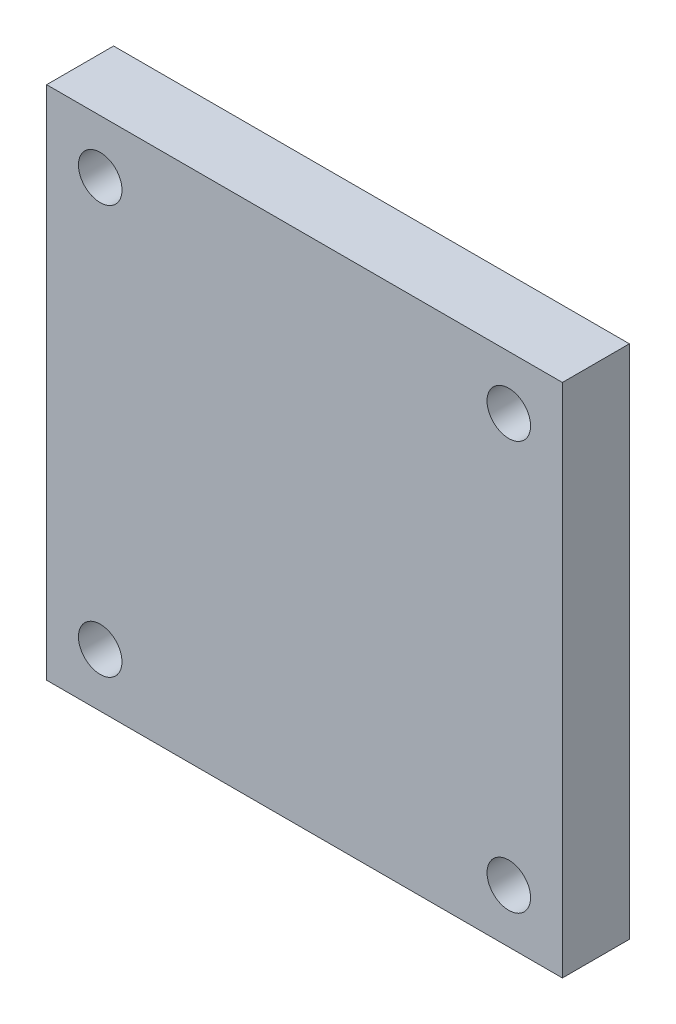
ISO-10303-21;
HEADER;
FILE_DESCRIPTION(('STEP AP214'),'2;1');
FILE_NAME('part.step','',(''),(''),'','','');
FILE_SCHEMA(('AUTOMOTIVE_DESIGN { 1 0 10303 214 1 1 1 1 }'));
ENDSEC;
DATA;
#1=APPLICATION_CONTEXT('core data for automotive mechanical design processes');
#2=APPLICATION_PROTOCOL_DEFINITION('international standard','automotive_design',2000,#1);
#3=PRODUCT_CONTEXT('',#1,'mechanical');
#4=PRODUCT('Part','Part','',(#3));
#5=PRODUCT_RELATED_PRODUCT_CATEGORY('part','',(#4));
#6=PRODUCT_DEFINITION_FORMATION('','',#4);
#7=PRODUCT_DEFINITION_CONTEXT('part definition',#1,'design');
#8=PRODUCT_DEFINITION('design','',#6,#7);
#9=PRODUCT_DEFINITION_SHAPE('','',#8);
#10=(LENGTH_UNIT() NAMED_UNIT(*) SI_UNIT(.MILLI.,.METRE.));
#11=(NAMED_UNIT(*) PLANE_ANGLE_UNIT() SI_UNIT($,.RADIAN.));
#12=(NAMED_UNIT(*) SI_UNIT($,.STERADIAN.) SOLID_ANGLE_UNIT());
#13=UNCERTAINTY_MEASURE_WITH_UNIT(LENGTH_MEASURE(1.E-05),#10,'distance_accuracy_value','');
#14=(GEOMETRIC_REPRESENTATION_CONTEXT(3) GLOBAL_UNCERTAINTY_ASSIGNED_CONTEXT((#13)) GLOBAL_UNIT_ASSIGNED_CONTEXT((#10,
#11,#12)) REPRESENTATION_CONTEXT('',''));
#15=CARTESIAN_POINT('',(0.,0.,0.));
#16=DIRECTION('',(0.,0.,1.));
#17=DIRECTION('',(1.,0.,0.));
#18=AXIS2_PLACEMENT_3D('',#15,#16,#17);
#19=CARTESIAN_POINT('',(0.,0.,10.));
#20=DIRECTION('',(0.,0.,-1.));
#21=DIRECTION('',(-1.,0.,0.));
#22=AXIS2_PLACEMENT_3D('',#19,#20,#21);
#23=PLANE('',#22);
#24=DIRECTION('',(0.,-1.,0.));
#25=VECTOR('',#24,1.);
#26=CARTESIAN_POINT('',(-77.,-77.,10.));
#27=LINE('',#26,#25);
#28=CARTESIAN_POINT('',(-77.,77.,10.));
#29=VERTEX_POINT('',#28);
#30=CARTESIAN_POINT('',(-77.,-77.,10.));
#31=VERTEX_POINT('',#30);
#32=EDGE_CURVE('E93',#29,#31,#27,.T.);
#33=ORIENTED_EDGE('',*,*,#32,.T.);
#34=DIRECTION('',(1.,0.,0.));
#35=VECTOR('',#34,1.);
#36=CARTESIAN_POINT('',(-77.,-77.,10.));
#37=LINE('',#36,#35);
#38=CARTESIAN_POINT('',(77.,-77.,10.));
#39=VERTEX_POINT('',#38);
#40=EDGE_CURVE('E88',#31,#39,#37,.T.);
#41=ORIENTED_EDGE('',*,*,#40,.T.);
#42=DIRECTION('',(0.,1.,0.));
#43=VECTOR('',#42,1.);
#44=CARTESIAN_POINT('',(77.,-77.,10.));
#45=LINE('',#44,#43);
#46=CARTESIAN_POINT('',(77.,77.,10.));
#47=VERTEX_POINT('',#46);
#48=EDGE_CURVE('E90',#39,#47,#45,.T.);
#49=ORIENTED_EDGE('',*,*,#48,.T.);
#50=DIRECTION('',(-1.,0.,0.));
#51=VECTOR('',#50,1.);
#52=CARTESIAN_POINT('',(-77.,77.,10.));
#53=LINE('',#52,#51);
#54=EDGE_CURVE('E57',#47,#29,#53,.T.);
#55=ORIENTED_EDGE('',*,*,#54,.T.);
#56=EDGE_LOOP('',(#33,#41,#49,#55));
#57=FACE_BOUND('',#56,.T.);
#58=CARTESIAN_POINT('',(-61.,61.,10.));
#59=DIRECTION('',(0.,0.,1.));
#60=DIRECTION('',(1.,0.,0.));
#61=AXIS2_PLACEMENT_3D('',#58,#59,#60);
#62=CIRCLE('',#61,6.50000000000003);
#63=CARTESIAN_POINT('',(-54.5,61.,10.));
#64=VERTEX_POINT('',#63);
#65=EDGE_CURVE('E106',#64,#64,#62,.T.);
#66=ORIENTED_EDGE('',*,*,#65,.F.);
#67=EDGE_LOOP('',(#66));
#68=FACE_BOUND('',#67,.T.);
#69=CARTESIAN_POINT('',(61.,61.,10.));
#70=DIRECTION('',(0.,0.,1.));
#71=DIRECTION('',(-1.,0.,0.));
#72=AXIS2_PLACEMENT_3D('',#69,#70,#71);
#73=CIRCLE('',#72,6.5);
#74=CARTESIAN_POINT('',(54.5,61.,10.));
#75=VERTEX_POINT('',#74);
#76=EDGE_CURVE('E121',#75,#75,#73,.T.);
#77=ORIENTED_EDGE('',*,*,#76,.F.);
#78=EDGE_LOOP('',(#77));
#79=FACE_BOUND('',#78,.T.);
#80=CARTESIAN_POINT('',(-61.,-61.,10.));
#81=DIRECTION('',(0.,0.,1.));
#82=DIRECTION('',(-1.,0.,0.));
#83=AXIS2_PLACEMENT_3D('',#80,#81,#82);
#84=CIRCLE('',#83,6.50000000000002);
#85=CARTESIAN_POINT('',(-67.5,-61.,10.));
#86=VERTEX_POINT('',#85);
#87=EDGE_CURVE('E130',#86,#86,#84,.T.);
#88=ORIENTED_EDGE('',*,*,#87,.F.);
#89=EDGE_LOOP('',(#88));
#90=FACE_BOUND('',#89,.T.);
#91=CARTESIAN_POINT('',(61.,-61.,10.));
#92=DIRECTION('',(0.,0.,1.));
#93=DIRECTION('',(1.,0.,0.));
#94=AXIS2_PLACEMENT_3D('',#91,#92,#93);
#95=CIRCLE('',#94,6.5);
#96=CARTESIAN_POINT('',(67.5,-61.,10.));
#97=VERTEX_POINT('',#96);
#98=EDGE_CURVE('E132',#97,#97,#95,.T.);
#99=ORIENTED_EDGE('',*,*,#98,.F.);
#100=EDGE_LOOP('',(#99));
#101=FACE_BOUND('',#100,.T.);
#102=ADVANCED_FACE('F39',(#57,#68,#79,#90,#101),#23,.F.);
#103=CARTESIAN_POINT('',(0.,0.,-10.));
#104=DIRECTION('',(0.,0.,-1.));
#105=DIRECTION('',(-1.,0.,0.));
#106=AXIS2_PLACEMENT_3D('',#103,#104,#105);
#107=PLANE('',#106);
#108=CARTESIAN_POINT('',(-61.,-61.,-10.));
#109=DIRECTION('',(0.,0.,1.));
#110=DIRECTION('',(-1.,0.,0.));
#111=AXIS2_PLACEMENT_3D('',#108,#109,#110);
#112=CIRCLE('',#111,6.50000000000002);
#113=CARTESIAN_POINT('',(-67.5,-61.,-10.));
#114=VERTEX_POINT('',#113);
#115=EDGE_CURVE('E128',#114,#114,#112,.T.);
#116=ORIENTED_EDGE('',*,*,#115,.T.);
#117=EDGE_LOOP('',(#116));
#118=FACE_BOUND('',#117,.T.);
#119=CARTESIAN_POINT('',(-61.,61.,-10.));
#120=DIRECTION('',(0.,0.,1.));
#121=DIRECTION('',(1.,0.,0.));
#122=AXIS2_PLACEMENT_3D('',#119,#120,#121);
#123=CIRCLE('',#122,6.50000000000003);
#124=CARTESIAN_POINT('',(-54.5,61.,-10.));
#125=VERTEX_POINT('',#124);
#126=EDGE_CURVE('E117',#125,#125,#123,.T.);
#127=ORIENTED_EDGE('',*,*,#126,.T.);
#128=EDGE_LOOP('',(#127));
#129=FACE_BOUND('',#128,.T.);
#130=DIRECTION('',(0.,-1.,0.));
#131=VECTOR('',#130,1.);
#132=CARTESIAN_POINT('',(-77.,-77.,-10.));
#133=LINE('',#132,#131);
#134=CARTESIAN_POINT('',(-77.,77.,-10.));
#135=VERTEX_POINT('',#134);
#136=CARTESIAN_POINT('',(-77.,-77.,-10.));
#137=VERTEX_POINT('',#136);
#138=EDGE_CURVE('E103',#135,#137,#133,.T.);
#139=ORIENTED_EDGE('',*,*,#138,.F.);
#140=DIRECTION('',(-1.,0.,0.));
#141=VECTOR('',#140,1.);
#142=CARTESIAN_POINT('',(-77.,77.,-10.));
#143=LINE('',#142,#141);
#144=CARTESIAN_POINT('',(77.,77.,-10.));
#145=VERTEX_POINT('',#144);
#146=EDGE_CURVE('E78',#145,#135,#143,.T.);
#147=ORIENTED_EDGE('',*,*,#146,.F.);
#148=DIRECTION('',(0.,1.,0.));
#149=VECTOR('',#148,1.);
#150=CARTESIAN_POINT('',(77.,-77.,-10.));
#151=LINE('',#150,#149);
#152=CARTESIAN_POINT('',(77.,-77.,-10.));
#153=VERTEX_POINT('',#152);
#154=EDGE_CURVE('E71',#153,#145,#151,.T.);
#155=ORIENTED_EDGE('',*,*,#154,.F.);
#156=DIRECTION('',(1.,0.,0.));
#157=VECTOR('',#156,1.);
#158=CARTESIAN_POINT('',(-77.,-77.,-10.));
#159=LINE('',#158,#157);
#160=EDGE_CURVE('E92',#137,#153,#159,.T.);
#161=ORIENTED_EDGE('',*,*,#160,.F.);
#162=EDGE_LOOP('',(#139,#147,#155,#161));
#163=FACE_BOUND('',#162,.T.);
#164=CARTESIAN_POINT('',(61.,61.,-10.));
#165=DIRECTION('',(0.,0.,1.));
#166=DIRECTION('',(-1.,0.,0.));
#167=AXIS2_PLACEMENT_3D('',#164,#165,#166);
#168=CIRCLE('',#167,6.5);
#169=CARTESIAN_POINT('',(54.5,61.,-10.));
#170=VERTEX_POINT('',#169);
#171=EDGE_CURVE('E122',#170,#170,#168,.T.);
#172=ORIENTED_EDGE('',*,*,#171,.T.);
#173=EDGE_LOOP('',(#172));
#174=FACE_BOUND('',#173,.T.);
#175=CARTESIAN_POINT('',(61.,-61.,-10.));
#176=DIRECTION('',(0.,0.,1.));
#177=DIRECTION('',(1.,0.,0.));
#178=AXIS2_PLACEMENT_3D('',#175,#176,#177);
#179=CIRCLE('',#178,6.5);
#180=CARTESIAN_POINT('',(67.5,-61.,-10.));
#181=VERTEX_POINT('',#180);
#182=EDGE_CURVE('E136',#181,#181,#179,.T.);
#183=ORIENTED_EDGE('',*,*,#182,.T.);
#184=EDGE_LOOP('',(#183));
#185=FACE_BOUND('',#184,.T.);
#186=ADVANCED_FACE('F111',(#118,#129,#163,#174,#185),#107,.T.);
#187=CARTESIAN_POINT('',(-77.,-77.,10.));
#188=DIRECTION('',(1.,0.,0.));
#189=DIRECTION('',(0.,0.,-1.));
#190=AXIS2_PLACEMENT_3D('',#187,#188,#189);
#191=PLANE('',#190);
#192=ORIENTED_EDGE('',*,*,#138,.T.);
#193=DIRECTION('',(0.,0.,-1.));
#194=VECTOR('',#193,1.);
#195=CARTESIAN_POINT('',(-77.,-77.,10.));
#196=LINE('',#195,#194);
#197=EDGE_CURVE('E11',#31,#137,#196,.T.);
#198=ORIENTED_EDGE('',*,*,#197,.F.);
#199=ORIENTED_EDGE('',*,*,#32,.F.);
#200=DIRECTION('',(0.,0.,-1.));
#201=VECTOR('',#200,1.);
#202=CARTESIAN_POINT('',(-77.,77.,10.));
#203=LINE('',#202,#201);
#204=EDGE_CURVE('E97',#29,#135,#203,.T.);
#205=ORIENTED_EDGE('',*,*,#204,.T.);
#206=EDGE_LOOP('',(#192,#198,#199,#205));
#207=FACE_BOUND('',#206,.T.);
#208=ADVANCED_FACE('F41',(#207),#191,.F.);
#209=CARTESIAN_POINT('',(-77.,-77.,10.));
#210=DIRECTION('',(0.,1.,0.));
#211=DIRECTION('',(0.,0.,1.));
#212=AXIS2_PLACEMENT_3D('',#209,#210,#211);
#213=PLANE('',#212);
#214=ORIENTED_EDGE('',*,*,#160,.T.);
#215=DIRECTION('',(0.,0.,-1.));
#216=VECTOR('',#215,1.);
#217=CARTESIAN_POINT('',(77.,-77.,10.));
#218=LINE('',#217,#216);
#219=EDGE_CURVE('E48',#39,#153,#218,.T.);
#220=ORIENTED_EDGE('',*,*,#219,.F.);
#221=ORIENTED_EDGE('',*,*,#40,.F.);
#222=ORIENTED_EDGE('',*,*,#197,.T.);
#223=EDGE_LOOP('',(#214,#220,#221,#222));
#224=FACE_BOUND('',#223,.T.);
#225=ADVANCED_FACE('F94',(#224),#213,.F.);
#226=CARTESIAN_POINT('',(77.,-77.,10.));
#227=DIRECTION('',(-1.,0.,0.));
#228=DIRECTION('',(0.,0.,1.));
#229=AXIS2_PLACEMENT_3D('',#226,#227,#228);
#230=PLANE('',#229);
#231=ORIENTED_EDGE('',*,*,#154,.T.);
#232=DIRECTION('',(0.,0.,-1.));
#233=VECTOR('',#232,1.);
#234=CARTESIAN_POINT('',(77.,77.,10.));
#235=LINE('',#234,#233);
#236=EDGE_CURVE('E96',#47,#145,#235,.T.);
#237=ORIENTED_EDGE('',*,*,#236,.F.);
#238=ORIENTED_EDGE('',*,*,#48,.F.);
#239=ORIENTED_EDGE('',*,*,#219,.T.);
#240=EDGE_LOOP('',(#231,#237,#238,#239));
#241=FACE_BOUND('',#240,.T.);
#242=ADVANCED_FACE('F100',(#241),#230,.F.);
#243=CARTESIAN_POINT('',(-77.,77.,10.));
#244=DIRECTION('',(0.,-1.,0.));
#245=DIRECTION('',(0.,0.,-1.));
#246=AXIS2_PLACEMENT_3D('',#243,#244,#245);
#247=PLANE('',#246);
#248=ORIENTED_EDGE('',*,*,#146,.T.);
#249=ORIENTED_EDGE('',*,*,#204,.F.);
#250=ORIENTED_EDGE('',*,*,#54,.F.);
#251=ORIENTED_EDGE('',*,*,#236,.T.);
#252=EDGE_LOOP('',(#248,#249,#250,#251));
#253=FACE_BOUND('',#252,.T.);
#254=ADVANCED_FACE('F112',(#253),#247,.F.);
#255=CARTESIAN_POINT('',(-61.,61.,10.));
#256=DIRECTION('',(0.,0.,-1.));
#257=DIRECTION('',(-1.,0.,0.));
#258=AXIS2_PLACEMENT_3D('',#255,#256,#257);
#259=CYLINDRICAL_SURFACE('',#258,6.50000000000003);
#260=ORIENTED_EDGE('',*,*,#65,.T.);
#261=EDGE_LOOP('',(#260));
#262=FACE_BOUND('',#261,.T.);
#263=ORIENTED_EDGE('',*,*,#126,.F.);
#264=EDGE_LOOP('',(#263));
#265=FACE_BOUND('',#264,.T.);
#266=ADVANCED_FACE('F153',(#262,#265),#259,.F.);
#267=CARTESIAN_POINT('',(61.,61.,10.));
#268=DIRECTION('',(0.,0.,-1.));
#269=DIRECTION('',(-1.,0.,0.));
#270=AXIS2_PLACEMENT_3D('',#267,#268,#269);
#271=CYLINDRICAL_SURFACE('',#270,6.5);
#272=ORIENTED_EDGE('',*,*,#76,.T.);
#273=EDGE_LOOP('',(#272));
#274=FACE_BOUND('',#273,.T.);
#275=ORIENTED_EDGE('',*,*,#171,.F.);
#276=EDGE_LOOP('',(#275));
#277=FACE_BOUND('',#276,.T.);
#278=ADVANCED_FACE('F187',(#274,#277),#271,.F.);
#279=CARTESIAN_POINT('',(-61.,-61.,10.));
#280=DIRECTION('',(0.,0.,-1.));
#281=DIRECTION('',(-1.,0.,0.));
#282=AXIS2_PLACEMENT_3D('',#279,#280,#281);
#283=CYLINDRICAL_SURFACE('',#282,6.50000000000002);
#284=ORIENTED_EDGE('',*,*,#87,.T.);
#285=EDGE_LOOP('',(#284));
#286=FACE_BOUND('',#285,.T.);
#287=ORIENTED_EDGE('',*,*,#115,.F.);
#288=EDGE_LOOP('',(#287));
#289=FACE_BOUND('',#288,.T.);
#290=ADVANCED_FACE('F194',(#286,#289),#283,.F.);
#291=CARTESIAN_POINT('',(61.,-61.,10.));
#292=DIRECTION('',(0.,0.,-1.));
#293=DIRECTION('',(-1.,0.,0.));
#294=AXIS2_PLACEMENT_3D('',#291,#292,#293);
#295=CYLINDRICAL_SURFACE('',#294,6.5);
#296=ORIENTED_EDGE('',*,*,#98,.T.);
#297=EDGE_LOOP('',(#296));
#298=FACE_BOUND('',#297,.T.);
#299=ORIENTED_EDGE('',*,*,#182,.F.);
#300=EDGE_LOOP('',(#299));
#301=FACE_BOUND('',#300,.T.);
#302=ADVANCED_FACE('F142',(#298,#301),#295,.F.);
#303=CLOSED_SHELL('',(#102,#186,#208,#225,#242,#254,#266,#278,#290,#302));
#304=MANIFOLD_SOLID_BREP('B2',#303);
#305=ADVANCED_BREP_SHAPE_REPRESENTATION('',(#18,#304),#14);
#306=SHAPE_DEFINITION_REPRESENTATION(#9,#305);
ENDSEC;
END-ISO-10303-21;
